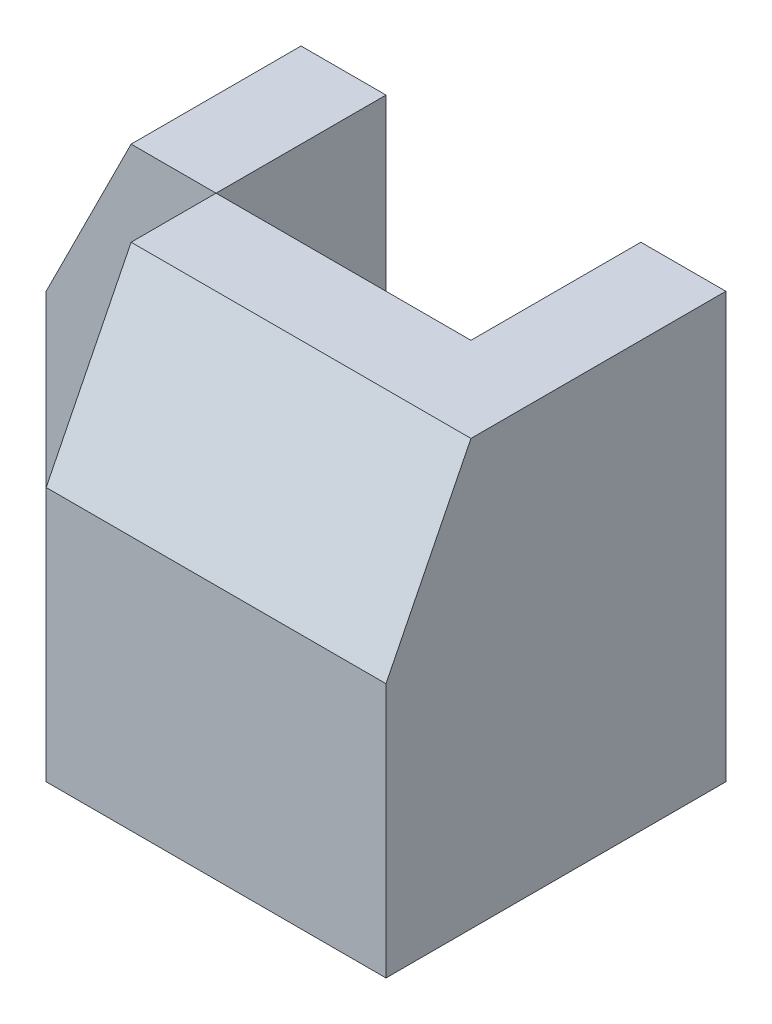
ISO-10303-21;
HEADER;
FILE_DESCRIPTION(('STEP AP214'),'2;1');
FILE_NAME('part.step','',(''),(''),'','','');
FILE_SCHEMA(('AUTOMOTIVE_DESIGN { 1 0 10303 214 1 1 1 1 }'));
ENDSEC;
DATA;
#1=APPLICATION_CONTEXT('core data for automotive mechanical design processes');
#2=APPLICATION_PROTOCOL_DEFINITION('international standard','automotive_design',2000,#1);
#3=PRODUCT_CONTEXT('',#1,'mechanical');
#4=PRODUCT('Part','Part','',(#3));
#5=PRODUCT_RELATED_PRODUCT_CATEGORY('part','',(#4));
#6=PRODUCT_DEFINITION_FORMATION('','',#4);
#7=PRODUCT_DEFINITION_CONTEXT('part definition',#1,'design');
#8=PRODUCT_DEFINITION('design','',#6,#7);
#9=PRODUCT_DEFINITION_SHAPE('','',#8);
#10=(LENGTH_UNIT() NAMED_UNIT(*) SI_UNIT(.MILLI.,.METRE.));
#11=(NAMED_UNIT(*) PLANE_ANGLE_UNIT() SI_UNIT($,.RADIAN.));
#12=(NAMED_UNIT(*) SI_UNIT($,.STERADIAN.) SOLID_ANGLE_UNIT());
#13=UNCERTAINTY_MEASURE_WITH_UNIT(LENGTH_MEASURE(1.E-05),#10,'distance_accuracy_value','');
#14=(GEOMETRIC_REPRESENTATION_CONTEXT(3) GLOBAL_UNCERTAINTY_ASSIGNED_CONTEXT((#13)) GLOBAL_UNIT_ASSIGNED_CONTEXT((#10,
#11,#12)) REPRESENTATION_CONTEXT('',''));
#15=CARTESIAN_POINT('',(0.,0.,0.));
#16=DIRECTION('',(0.,0.,1.));
#17=DIRECTION('',(1.,0.,0.));
#18=AXIS2_PLACEMENT_3D('',#15,#16,#17);
#19=CARTESIAN_POINT('',(0.,0.,20.));
#20=DIRECTION('',(0.,1.,0.));
#21=DIRECTION('',(0.,0.,1.));
#22=AXIS2_PLACEMENT_3D('',#19,#20,#21);
#23=PLANE('',#22);
#24=DIRECTION('',(0.,0.,-1.));
#25=VECTOR('',#24,1.);
#26=CARTESIAN_POINT('',(20.,0.,10.));
#27=LINE('',#26,#25);
#28=CARTESIAN_POINT('',(20.,0.,10.));
#29=VERTEX_POINT('',#28);
#30=CARTESIAN_POINT('',(20.,0.,0.));
#31=VERTEX_POINT('',#30);
#32=EDGE_CURVE('E152',#29,#31,#27,.T.);
#33=ORIENTED_EDGE('',*,*,#32,.T.);
#34=DIRECTION('',(1.,0.,0.));
#35=VECTOR('',#34,1.);
#36=CARTESIAN_POINT('',(0.,0.,0.));
#37=LINE('',#36,#35);
#38=CARTESIAN_POINT('',(30.,0.,0.));
#39=VERTEX_POINT('',#38);
#40=EDGE_CURVE('E46',#31,#39,#37,.T.);
#41=ORIENTED_EDGE('',*,*,#40,.T.);
#42=DIRECTION('',(0.,0.,-1.));
#43=VECTOR('',#42,1.);
#44=CARTESIAN_POINT('',(30.,0.,20.));
#45=LINE('',#44,#43);
#46=CARTESIAN_POINT('',(30.,0.,20.));
#47=VERTEX_POINT('',#46);
#48=EDGE_CURVE('E139',#47,#39,#45,.T.);
#49=ORIENTED_EDGE('',*,*,#48,.F.);
#50=DIRECTION('',(1.,0.,0.));
#51=VECTOR('',#50,1.);
#52=CARTESIAN_POINT('',(0.,0.,20.));
#53=LINE('',#52,#51);
#54=CARTESIAN_POINT('',(10.,0.,20.));
#55=VERTEX_POINT('',#54);
#56=EDGE_CURVE('E145',#55,#47,#53,.T.);
#57=ORIENTED_EDGE('',*,*,#56,.F.);
#58=DIRECTION('',(0.,0.,1.));
#59=VECTOR('',#58,1.);
#60=CARTESIAN_POINT('',(10.,0.,10.));
#61=LINE('',#60,#59);
#62=CARTESIAN_POINT('',(10.,0.,10.));
#63=VERTEX_POINT('',#62);
#64=EDGE_CURVE('E147',#63,#55,#61,.T.);
#65=ORIENTED_EDGE('',*,*,#64,.F.);
#66=DIRECTION('',(-1.,0.,0.));
#67=VECTOR('',#66,1.);
#68=CARTESIAN_POINT('',(20.,0.,10.));
#69=LINE('',#68,#67);
#70=EDGE_CURVE('E51',#29,#63,#69,.T.);
#71=ORIENTED_EDGE('',*,*,#70,.F.);
#72=EDGE_LOOP('',(#33,#41,#49,#57,#65,#71));
#73=FACE_BOUND('',#72,.T.);
#74=ADVANCED_FACE('F43',(#73),#23,.F.);
#75=CARTESIAN_POINT('',(0.,25.,20.));
#76=DIRECTION('',(0.,-1.,0.));
#77=DIRECTION('',(0.,0.,-1.));
#78=AXIS2_PLACEMENT_3D('',#75,#76,#77);
#79=PLANE('',#78);
#80=DIRECTION('',(0.,0.,1.));
#81=VECTOR('',#80,1.);
#82=CARTESIAN_POINT('',(10.,25.,10.));
#83=LINE('',#82,#81);
#84=CARTESIAN_POINT('',(10.,25.,10.));
#85=VERTEX_POINT('',#84);
#86=CARTESIAN_POINT('',(10.,25.,15.));
#87=VERTEX_POINT('',#86);
#88=EDGE_CURVE('E125',#85,#87,#83,.T.);
#89=ORIENTED_EDGE('',*,*,#88,.T.);
#90=DIRECTION('',(-1.,0.,0.));
#91=VECTOR('',#90,1.);
#92=CARTESIAN_POINT('',(30.,25.,15.));
#93=LINE('',#92,#91);
#94=CARTESIAN_POINT('',(30.,25.,15.));
#95=VERTEX_POINT('',#94);
#96=EDGE_CURVE('E59',#95,#87,#93,.T.);
#97=ORIENTED_EDGE('',*,*,#96,.F.);
#98=DIRECTION('',(0.,0.,-1.));
#99=VECTOR('',#98,1.);
#100=CARTESIAN_POINT('',(30.,25.,20.));
#101=LINE('',#100,#99);
#102=CARTESIAN_POINT('',(30.,25.,0.));
#103=VERTEX_POINT('',#102);
#104=EDGE_CURVE('E121',#95,#103,#101,.T.);
#105=ORIENTED_EDGE('',*,*,#104,.T.);
#106=DIRECTION('',(-1.,0.,0.));
#107=VECTOR('',#106,1.);
#108=CARTESIAN_POINT('',(0.,25.,0.));
#109=LINE('',#108,#107);
#110=CARTESIAN_POINT('',(25.,25.,0.));
#111=VERTEX_POINT('',#110);
#112=EDGE_CURVE('E132',#103,#111,#109,.T.);
#113=ORIENTED_EDGE('',*,*,#112,.T.);
#114=DIRECTION('',(0.,0.,-1.));
#115=VECTOR('',#114,1.);
#116=CARTESIAN_POINT('',(25.,25.,10.));
#117=LINE('',#116,#115);
#118=CARTESIAN_POINT('',(25.,25.,10.));
#119=VERTEX_POINT('',#118);
#120=EDGE_CURVE('E171',#119,#111,#117,.T.);
#121=ORIENTED_EDGE('',*,*,#120,.F.);
#122=DIRECTION('',(-1.,0.,0.));
#123=VECTOR('',#122,1.);
#124=CARTESIAN_POINT('',(20.,25.,10.));
#125=LINE('',#124,#123);
#126=EDGE_CURVE('E135',#119,#85,#125,.T.);
#127=ORIENTED_EDGE('',*,*,#126,.T.);
#128=EDGE_LOOP('',(#89,#97,#105,#113,#121,#127));
#129=FACE_BOUND('',#128,.T.);
#130=ADVANCED_FACE('F119',(#129),#79,.F.);
#131=CARTESIAN_POINT('',(0.,0.,0.));
#132=DIRECTION('',(0.,0.,-1.));
#133=DIRECTION('',(-1.,0.,0.));
#134=AXIS2_PLACEMENT_3D('',#131,#132,#133);
#135=PLANE('',#134);
#136=DIRECTION('',(-0.447213595499958,-0.894427190999916,0.));
#137=VECTOR('',#136,1.);
#138=CARTESIAN_POINT('',(25.,25.,0.));
#139=LINE('',#138,#137);
#140=CARTESIAN_POINT('',(20.,15.,0.));
#141=VERTEX_POINT('',#140);
#142=EDGE_CURVE('E170',#111,#141,#139,.T.);
#143=ORIENTED_EDGE('',*,*,#142,.F.);
#144=ORIENTED_EDGE('',*,*,#112,.F.);
#145=DIRECTION('',(0.,1.,0.));
#146=VECTOR('',#145,1.);
#147=CARTESIAN_POINT('',(30.,0.,0.));
#148=LINE('',#147,#146);
#149=EDGE_CURVE('E130',#39,#103,#148,.T.);
#150=ORIENTED_EDGE('',*,*,#149,.F.);
#151=ORIENTED_EDGE('',*,*,#40,.F.);
#152=DIRECTION('',(0.,1.,0.));
#153=VECTOR('',#152,1.);
#154=CARTESIAN_POINT('',(20.,0.,0.));
#155=LINE('',#154,#153);
#156=EDGE_CURVE('E134',#31,#141,#155,.T.);
#157=ORIENTED_EDGE('',*,*,#156,.T.);
#158=EDGE_LOOP('',(#143,#144,#150,#151,#157));
#159=FACE_BOUND('',#158,.T.);
#160=ADVANCED_FACE('F169',(#159),#135,.T.);
#161=CARTESIAN_POINT('',(30.,0.,20.));
#162=DIRECTION('',(-1.,0.,0.));
#163=DIRECTION('',(0.,0.,1.));
#164=AXIS2_PLACEMENT_3D('',#161,#162,#163);
#165=PLANE('',#164);
#166=ORIENTED_EDGE('',*,*,#104,.F.);
#167=DIRECTION('',(0.,-0.894427190999916,0.447213595499958));
#168=VECTOR('',#167,1.);
#169=CARTESIAN_POINT('',(30.,25.,15.));
#170=LINE('',#169,#168);
#171=CARTESIAN_POINT('',(30.,15.,20.));
#172=VERTEX_POINT('',#171);
#173=EDGE_CURVE('E107',#95,#172,#170,.T.);
#174=ORIENTED_EDGE('',*,*,#173,.T.);
#175=DIRECTION('',(0.,1.,0.));
#176=VECTOR('',#175,1.);
#177=CARTESIAN_POINT('',(30.,0.,20.));
#178=LINE('',#177,#176);
#179=EDGE_CURVE('E142',#47,#172,#178,.T.);
#180=ORIENTED_EDGE('',*,*,#179,.F.);
#181=ORIENTED_EDGE('',*,*,#48,.T.);
#182=ORIENTED_EDGE('',*,*,#149,.T.);
#183=EDGE_LOOP('',(#166,#174,#180,#181,#182));
#184=FACE_BOUND('',#183,.T.);
#185=ADVANCED_FACE('F127',(#184),#165,.F.);
#186=CARTESIAN_POINT('',(0.,0.,20.));
#187=DIRECTION('',(0.,0.,-1.));
#188=DIRECTION('',(-1.,0.,0.));
#189=AXIS2_PLACEMENT_3D('',#186,#187,#188);
#190=PLANE('',#189);
#191=ORIENTED_EDGE('',*,*,#179,.T.);
#192=DIRECTION('',(-1.,0.,0.));
#193=VECTOR('',#192,1.);
#194=CARTESIAN_POINT('',(30.,15.,20.));
#195=LINE('',#194,#193);
#196=CARTESIAN_POINT('',(10.,15.,20.));
#197=VERTEX_POINT('',#196);
#198=EDGE_CURVE('E110',#172,#197,#195,.T.);
#199=ORIENTED_EDGE('',*,*,#198,.T.);
#200=DIRECTION('',(0.,1.,0.));
#201=VECTOR('',#200,1.);
#202=CARTESIAN_POINT('',(10.,0.,20.));
#203=LINE('',#202,#201);
#204=EDGE_CURVE('E144',#55,#197,#203,.T.);
#205=ORIENTED_EDGE('',*,*,#204,.F.);
#206=ORIENTED_EDGE('',*,*,#56,.T.);
#207=EDGE_LOOP('',(#191,#199,#205,#206));
#208=FACE_BOUND('',#207,.T.);
#209=ADVANCED_FACE('F182',(#208),#190,.F.);
#210=CARTESIAN_POINT('',(10.,0.,10.));
#211=DIRECTION('',(1.,0.,0.));
#212=DIRECTION('',(0.,0.,-1.));
#213=AXIS2_PLACEMENT_3D('',#210,#211,#212);
#214=PLANE('',#213);
#215=ORIENTED_EDGE('',*,*,#204,.T.);
#216=DIRECTION('',(0.,-0.894427190999916,0.447213595499958));
#217=VECTOR('',#216,1.);
#218=CARTESIAN_POINT('',(10.,25.,15.));
#219=LINE('',#218,#217);
#220=EDGE_CURVE('E115',#87,#197,#219,.T.);
#221=ORIENTED_EDGE('',*,*,#220,.F.);
#222=ORIENTED_EDGE('',*,*,#88,.F.);
#223=DIRECTION('',(0.,1.,0.));
#224=VECTOR('',#223,1.);
#225=CARTESIAN_POINT('',(10.,0.,10.));
#226=LINE('',#225,#224);
#227=EDGE_CURVE('E12',#63,#85,#226,.T.);
#228=ORIENTED_EDGE('',*,*,#227,.F.);
#229=ORIENTED_EDGE('',*,*,#64,.T.);
#230=EDGE_LOOP('',(#215,#221,#222,#228,#229));
#231=FACE_BOUND('',#230,.T.);
#232=ADVANCED_FACE('F183',(#231),#214,.F.);
#233=CARTESIAN_POINT('',(20.,0.,10.));
#234=DIRECTION('',(-1.,0.,0.));
#235=DIRECTION('',(0.,0.,1.));
#236=AXIS2_PLACEMENT_3D('',#233,#234,#235);
#237=PLANE('',#236);
#238=DIRECTION('',(0.,0.,-1.));
#239=VECTOR('',#238,1.);
#240=CARTESIAN_POINT('',(20.,15.,10.));
#241=LINE('',#240,#239);
#242=CARTESIAN_POINT('',(20.,15.,10.));
#243=VERTEX_POINT('',#242);
#244=EDGE_CURVE('E155',#243,#141,#241,.T.);
#245=ORIENTED_EDGE('',*,*,#244,.T.);
#246=ORIENTED_EDGE('',*,*,#156,.F.);
#247=ORIENTED_EDGE('',*,*,#32,.F.);
#248=DIRECTION('',(0.,1.,0.));
#249=VECTOR('',#248,1.);
#250=CARTESIAN_POINT('',(20.,0.,10.));
#251=LINE('',#250,#249);
#252=EDGE_CURVE('E148',#29,#243,#251,.T.);
#253=ORIENTED_EDGE('',*,*,#252,.T.);
#254=EDGE_LOOP('',(#245,#246,#247,#253));
#255=FACE_BOUND('',#254,.T.);
#256=ADVANCED_FACE('F188',(#255),#237,.T.);
#257=CARTESIAN_POINT('',(0.,0.,10.));
#258=DIRECTION('',(0.,0.,-1.));
#259=DIRECTION('',(-1.,0.,0.));
#260=AXIS2_PLACEMENT_3D('',#257,#258,#259);
#261=PLANE('',#260);
#262=ORIENTED_EDGE('',*,*,#126,.F.);
#263=DIRECTION('',(-0.447213595499958,-0.894427190999916,0.));
#264=VECTOR('',#263,1.);
#265=CARTESIAN_POINT('',(25.,25.,10.));
#266=LINE('',#265,#264);
#267=EDGE_CURVE('E67',#119,#243,#266,.T.);
#268=ORIENTED_EDGE('',*,*,#267,.T.);
#269=ORIENTED_EDGE('',*,*,#252,.F.);
#270=ORIENTED_EDGE('',*,*,#70,.T.);
#271=ORIENTED_EDGE('',*,*,#227,.T.);
#272=EDGE_LOOP('',(#262,#268,#269,#270,#271));
#273=FACE_BOUND('',#272,.T.);
#274=ADVANCED_FACE('F186',(#273),#261,.T.);
#275=CARTESIAN_POINT('',(25.,25.,10.));
#276=DIRECTION('',(0.894427190999916,-0.447213595499958,0.));
#277=DIRECTION('',(0.447213595499958,0.894427190999916,0.));
#278=AXIS2_PLACEMENT_3D('',#275,#276,#277);
#279=PLANE('',#278);
#280=ORIENTED_EDGE('',*,*,#142,.T.);
#281=ORIENTED_EDGE('',*,*,#244,.F.);
#282=ORIENTED_EDGE('',*,*,#267,.F.);
#283=ORIENTED_EDGE('',*,*,#120,.T.);
#284=EDGE_LOOP('',(#280,#281,#282,#283));
#285=FACE_BOUND('',#284,.T.);
#286=ADVANCED_FACE('F189',(#285),#279,.F.);
#287=CARTESIAN_POINT('',(30.,25.,15.));
#288=DIRECTION('',(0.,-0.447213595499958,-0.894427190999916));
#289=DIRECTION('',(0.,0.894427190999916,-0.447213595499958));
#290=AXIS2_PLACEMENT_3D('',#287,#288,#289);
#291=PLANE('',#290);
#292=ORIENTED_EDGE('',*,*,#220,.T.);
#293=ORIENTED_EDGE('',*,*,#198,.F.);
#294=ORIENTED_EDGE('',*,*,#173,.F.);
#295=ORIENTED_EDGE('',*,*,#96,.T.);
#296=EDGE_LOOP('',(#292,#293,#294,#295));
#297=FACE_BOUND('',#296,.T.);
#298=ADVANCED_FACE('F108',(#297),#291,.F.);
#299=CLOSED_SHELL('',(#74,#130,#160,#185,#209,#232,#256,#274,#286,#298));
#300=MANIFOLD_SOLID_BREP('B2',#299);
#301=CARTESIAN_POINT('',(0.,0.,20.));
#302=DIRECTION('',(1.,0.,0.));
#303=DIRECTION('',(0.,0.,-1.));
#304=AXIS2_PLACEMENT_3D('',#301,#302,#303);
#305=PLANE('',#304);
#306=DIRECTION('',(0.,-1.,0.));
#307=VECTOR('',#306,1.);
#308=CARTESIAN_POINT('',(0.,0.,10.));
#309=LINE('',#308,#307);
#310=CARTESIAN_POINT('',(0.,15.,10.));
#311=VERTEX_POINT('',#310);
#312=CARTESIAN_POINT('',(0.,0.,10.));
#313=VERTEX_POINT('',#312);
#314=EDGE_CURVE('E351',#311,#313,#309,.T.);
#315=ORIENTED_EDGE('',*,*,#314,.F.);
#316=DIRECTION('',(0.,0.,1.));
#317=VECTOR('',#316,1.);
#318=CARTESIAN_POINT('',(0.,15.,0.));
#319=LINE('',#318,#317);
#320=CARTESIAN_POINT('',(0.,15.,0.));
#321=VERTEX_POINT('',#320);
#322=EDGE_CURVE('E295',#321,#311,#319,.T.);
#323=ORIENTED_EDGE('',*,*,#322,.F.);
#324=DIRECTION('',(0.,-1.,0.));
#325=VECTOR('',#324,1.);
#326=CARTESIAN_POINT('',(0.,0.,0.));
#327=LINE('',#326,#325);
#328=CARTESIAN_POINT('',(0.,0.,0.));
#329=VERTEX_POINT('',#328);
#330=EDGE_CURVE('E344',#321,#329,#327,.T.);
#331=ORIENTED_EDGE('',*,*,#330,.T.);
#332=DIRECTION('',(0.,0.,-1.));
#333=VECTOR('',#332,1.);
#334=CARTESIAN_POINT('',(0.,0.,20.));
#335=LINE('',#334,#333);
#336=EDGE_CURVE('E277',#313,#329,#335,.T.);
#337=ORIENTED_EDGE('',*,*,#336,.F.);
#338=EDGE_LOOP('',(#315,#323,#331,#337));
#339=FACE_BOUND('',#338,.T.);
#340=ADVANCED_FACE('F274',(#339),#305,.F.);
#341=CARTESIAN_POINT('',(5.,25.,0.));
#342=DIRECTION('',(0.894427190999916,-0.447213595499958,0.));
#343=DIRECTION('',(0.447213595499958,0.894427190999916,0.));
#344=AXIS2_PLACEMENT_3D('',#341,#342,#343);
#345=PLANE('',#344);
#346=DIRECTION('',(0.447213595499958,0.894427190999916,0.));
#347=VECTOR('',#346,1.);
#348=CARTESIAN_POINT('',(5.,25.,10.));
#349=LINE('',#348,#347);
#350=CARTESIAN_POINT('',(5.,25.,10.));
#351=VERTEX_POINT('',#350);
#352=EDGE_CURVE('E336',#311,#351,#349,.T.);
#353=ORIENTED_EDGE('',*,*,#352,.T.);
#354=DIRECTION('',(0.,0.,1.));
#355=VECTOR('',#354,1.);
#356=CARTESIAN_POINT('',(5.,25.,0.));
#357=LINE('',#356,#355);
#358=CARTESIAN_POINT('',(5.,25.,0.));
#359=VERTEX_POINT('',#358);
#360=EDGE_CURVE('E353',#359,#351,#357,.T.);
#361=ORIENTED_EDGE('',*,*,#360,.F.);
#362=DIRECTION('',(0.447213595499958,0.894427190999916,0.));
#363=VECTOR('',#362,1.);
#364=CARTESIAN_POINT('',(5.,25.,0.));
#365=LINE('',#364,#363);
#366=EDGE_CURVE('E341',#321,#359,#365,.T.);
#367=ORIENTED_EDGE('',*,*,#366,.F.);
#368=ORIENTED_EDGE('',*,*,#322,.T.);
#369=EDGE_LOOP('',(#353,#361,#367,#368));
#370=FACE_BOUND('',#369,.T.);
#371=ADVANCED_FACE('F358',(#370),#345,.F.);
#372=CARTESIAN_POINT('',(0.,0.,0.));
#373=DIRECTION('',(0.,0.,-1.));
#374=DIRECTION('',(-1.,0.,0.));
#375=AXIS2_PLACEMENT_3D('',#372,#373,#374);
#376=PLANE('',#375);
#377=DIRECTION('',(0.,1.,0.));
#378=VECTOR('',#377,1.);
#379=CARTESIAN_POINT('',(10.,0.,0.));
#380=LINE('',#379,#378);
#381=CARTESIAN_POINT('',(10.,0.,0.));
#382=VERTEX_POINT('',#381);
#383=CARTESIAN_POINT('',(10.,25.,0.));
#384=VERTEX_POINT('',#383);
#385=EDGE_CURVE('E317',#382,#384,#380,.T.);
#386=ORIENTED_EDGE('',*,*,#385,.F.);
#387=DIRECTION('',(1.,0.,0.));
#388=VECTOR('',#387,1.);
#389=CARTESIAN_POINT('',(0.,0.,0.));
#390=LINE('',#389,#388);
#391=EDGE_CURVE('E342',#329,#382,#390,.T.);
#392=ORIENTED_EDGE('',*,*,#391,.F.);
#393=ORIENTED_EDGE('',*,*,#330,.F.);
#394=ORIENTED_EDGE('',*,*,#366,.T.);
#395=DIRECTION('',(-1.,0.,0.));
#396=VECTOR('',#395,1.);
#397=CARTESIAN_POINT('',(0.,25.,0.));
#398=LINE('',#397,#396);
#399=EDGE_CURVE('E332',#384,#359,#398,.T.);
#400=ORIENTED_EDGE('',*,*,#399,.F.);
#401=EDGE_LOOP('',(#386,#392,#393,#394,#400));
#402=FACE_BOUND('',#401,.T.);
#403=ADVANCED_FACE('F339',(#402),#376,.T.);
#404=CARTESIAN_POINT('',(0.,0.,10.));
#405=DIRECTION('',(0.,0.,-1.));
#406=DIRECTION('',(-1.,0.,0.));
#407=AXIS2_PLACEMENT_3D('',#404,#405,#406);
#408=PLANE('',#407);
#409=DIRECTION('',(-1.,0.,0.));
#410=VECTOR('',#409,1.);
#411=CARTESIAN_POINT('',(0.,25.,10.));
#412=LINE('',#411,#410);
#413=CARTESIAN_POINT('',(10.,25.,10.));
#414=VERTEX_POINT('',#413);
#415=EDGE_CURVE('E335',#414,#351,#412,.T.);
#416=ORIENTED_EDGE('',*,*,#415,.T.);
#417=ORIENTED_EDGE('',*,*,#352,.F.);
#418=ORIENTED_EDGE('',*,*,#314,.T.);
#419=DIRECTION('',(1.,0.,0.));
#420=VECTOR('',#419,1.);
#421=CARTESIAN_POINT('',(0.,0.,10.));
#422=LINE('',#421,#420);
#423=CARTESIAN_POINT('',(10.,0.,10.));
#424=VERTEX_POINT('',#423);
#425=EDGE_CURVE('E348',#313,#424,#422,.T.);
#426=ORIENTED_EDGE('',*,*,#425,.T.);
#427=DIRECTION('',(0.,1.,0.));
#428=VECTOR('',#427,1.);
#429=CARTESIAN_POINT('',(10.,0.,10.));
#430=LINE('',#429,#428);
#431=EDGE_CURVE('E41',#424,#414,#430,.T.);
#432=ORIENTED_EDGE('',*,*,#431,.T.);
#433=EDGE_LOOP('',(#416,#417,#418,#426,#432));
#434=FACE_BOUND('',#433,.T.);
#435=ADVANCED_FACE('F361',(#434),#408,.F.);
#436=CARTESIAN_POINT('',(0.,25.,20.));
#437=DIRECTION('',(0.,-1.,0.));
#438=DIRECTION('',(0.,0.,-1.));
#439=AXIS2_PLACEMENT_3D('',#436,#437,#438);
#440=PLANE('',#439);
#441=ORIENTED_EDGE('',*,*,#415,.F.);
#442=DIRECTION('',(0.,0.,-1.));
#443=VECTOR('',#442,1.);
#444=CARTESIAN_POINT('',(10.,25.,10.));
#445=LINE('',#444,#443);
#446=EDGE_CURVE('E320',#414,#384,#445,.T.);
#447=ORIENTED_EDGE('',*,*,#446,.T.);
#448=ORIENTED_EDGE('',*,*,#399,.T.);
#449=ORIENTED_EDGE('',*,*,#360,.T.);
#450=EDGE_LOOP('',(#441,#447,#448,#449));
#451=FACE_BOUND('',#450,.T.);
#452=ADVANCED_FACE('F330',(#451),#440,.F.);
#453=CARTESIAN_POINT('',(0.,0.,20.));
#454=DIRECTION('',(0.,1.,0.));
#455=DIRECTION('',(0.,0.,1.));
#456=AXIS2_PLACEMENT_3D('',#453,#454,#455);
#457=PLANE('',#456);
#458=ORIENTED_EDGE('',*,*,#391,.T.);
#459=DIRECTION('',(0.,0.,-1.));
#460=VECTOR('',#459,1.);
#461=CARTESIAN_POINT('',(10.,0.,10.));
#462=LINE('',#461,#460);
#463=EDGE_CURVE('E322',#424,#382,#462,.T.);
#464=ORIENTED_EDGE('',*,*,#463,.F.);
#465=ORIENTED_EDGE('',*,*,#425,.F.);
#466=ORIENTED_EDGE('',*,*,#336,.T.);
#467=EDGE_LOOP('',(#458,#464,#465,#466));
#468=FACE_BOUND('',#467,.T.);
#469=ADVANCED_FACE('F365',(#468),#457,.F.);
#470=CARTESIAN_POINT('',(10.,0.,10.));
#471=DIRECTION('',(-1.,0.,0.));
#472=DIRECTION('',(0.,-1.,0.));
#473=AXIS2_PLACEMENT_3D('',#470,#471,#472);
#474=PLANE('',#473);
#475=ORIENTED_EDGE('',*,*,#385,.T.);
#476=ORIENTED_EDGE('',*,*,#446,.F.);
#477=ORIENTED_EDGE('',*,*,#431,.F.);
#478=ORIENTED_EDGE('',*,*,#463,.T.);
#479=EDGE_LOOP('',(#475,#476,#477,#478));
#480=FACE_BOUND('',#479,.T.);
#481=ADVANCED_FACE('F319',(#480),#474,.F.);
#482=CLOSED_SHELL('',(#340,#371,#403,#435,#452,#469,#481));
#483=MANIFOLD_SOLID_BREP('B6',#482);
#484=ADVANCED_BREP_SHAPE_REPRESENTATION('',(#18,#300,#483),#14);
#485=SHAPE_DEFINITION_REPRESENTATION(#9,#484);
ENDSEC;
END-ISO-10303-21;
